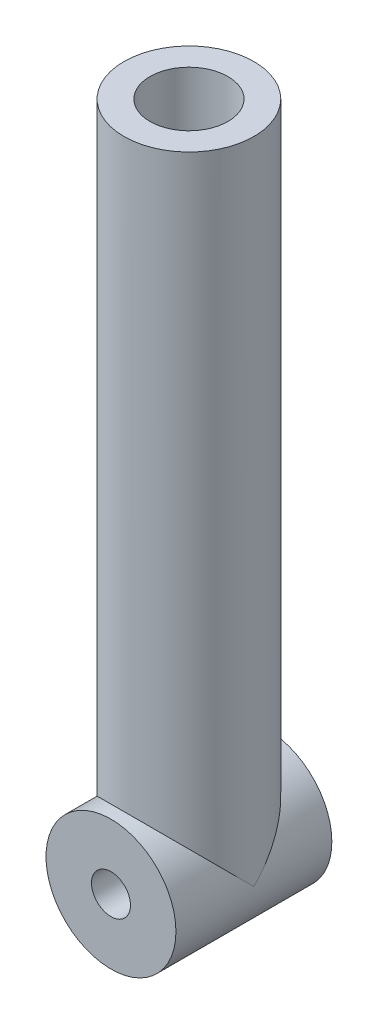
ISO-10303-21;
HEADER;
FILE_DESCRIPTION(('STEP AP214'),'2;1');
FILE_NAME('part.step','',(''),(''),'','','');
FILE_SCHEMA(('AUTOMOTIVE_DESIGN { 1 0 10303 214 1 1 1 1 }'));
ENDSEC;
DATA;
#1=APPLICATION_CONTEXT('core data for automotive mechanical design processes');
#2=APPLICATION_PROTOCOL_DEFINITION('international standard','automotive_design',2000,#1);
#3=PRODUCT_CONTEXT('',#1,'mechanical');
#4=PRODUCT('Part','Part','',(#3));
#5=PRODUCT_RELATED_PRODUCT_CATEGORY('part','',(#4));
#6=PRODUCT_DEFINITION_FORMATION('','',#4);
#7=PRODUCT_DEFINITION_CONTEXT('part definition',#1,'design');
#8=PRODUCT_DEFINITION('design','',#6,#7);
#9=PRODUCT_DEFINITION_SHAPE('','',#8);
#10=(LENGTH_UNIT() NAMED_UNIT(*) SI_UNIT(.MILLI.,.METRE.));
#11=(NAMED_UNIT(*) PLANE_ANGLE_UNIT() SI_UNIT($,.RADIAN.));
#12=(NAMED_UNIT(*) SI_UNIT($,.STERADIAN.) SOLID_ANGLE_UNIT());
#13=UNCERTAINTY_MEASURE_WITH_UNIT(LENGTH_MEASURE(1.E-05),#10,'distance_accuracy_value','');
#14=(GEOMETRIC_REPRESENTATION_CONTEXT(3) GLOBAL_UNCERTAINTY_ASSIGNED_CONTEXT((#13)) GLOBAL_UNIT_ASSIGNED_CONTEXT((#10,
#11,#12)) REPRESENTATION_CONTEXT('',''));
#15=CARTESIAN_POINT('',(0.,0.,0.));
#16=DIRECTION('',(0.,0.,1.));
#17=DIRECTION('',(1.,0.,0.));
#18=AXIS2_PLACEMENT_3D('',#15,#16,#17);
#19=CARTESIAN_POINT('',(0.,250.,0.));
#20=DIRECTION('',(0.,-1.,0.));
#21=DIRECTION('',(0.,0.,-1.));
#22=AXIS2_PLACEMENT_3D('',#19,#20,#21);
#23=CYLINDRICAL_SURFACE('',#22,25.);
#24=CARTESIAN_POINT('',(0.,250.,0.));
#25=DIRECTION('',(0.,1.,0.));
#26=DIRECTION('',(0.,0.,1.));
#27=AXIS2_PLACEMENT_3D('',#24,#25,#26);
#28=CIRCLE('',#27,25.);
#29=CARTESIAN_POINT('',(0.,250.,25.));
#30=VERTEX_POINT('',#29);
#31=EDGE_CURVE('E10',#30,#30,#28,.T.);
#32=ORIENTED_EDGE('',*,*,#31,.F.);
#33=EDGE_LOOP('',(#32));
#34=FACE_BOUND('',#33,.T.);
#35=CARTESIAN_POINT('',(0.,0.,0.));
#36=DIRECTION('',(0.,-0.707106781186548,-0.707106781186548));
#37=DIRECTION('',(0.,-0.707106781186548,0.707106781186548));
#38=AXIS2_PLACEMENT_3D('',#35,#36,#37);
#39=ELLIPSE('',#38,35.3553390593274,25.);
#40=CARTESIAN_POINT('',(-25.,0.,0.));
#41=VERTEX_POINT('',#40);
#42=CARTESIAN_POINT('',(25.,0.,0.));
#43=VERTEX_POINT('',#42);
#44=EDGE_CURVE('E23',#41,#43,#39,.T.);
#45=ORIENTED_EDGE('',*,*,#44,.F.);
#46=CARTESIAN_POINT('',(0.,0.,0.));
#47=DIRECTION('',(0.,-0.707106781186548,0.707106781186548));
#48=DIRECTION('',(0.,-0.707106781186548,-0.707106781186548));
#49=AXIS2_PLACEMENT_3D('',#46,#47,#48);
#50=ELLIPSE('',#49,35.3553390593274,25.);
#51=EDGE_CURVE('E29',#43,#41,#50,.T.);
#52=ORIENTED_EDGE('',*,*,#51,.F.);
#53=EDGE_LOOP('',(#45,#52));
#54=FACE_BOUND('',#53,.T.);
#55=ADVANCED_FACE('F16',(#34,#54),#23,.T.);
#56=CARTESIAN_POINT('',(0.,250.,0.));
#57=DIRECTION('',(0.,1.,0.));
#58=DIRECTION('',(0.,0.,1.));
#59=AXIS2_PLACEMENT_3D('',#56,#57,#58);
#60=PLANE('',#59);
#61=CARTESIAN_POINT('',(0.,250.,0.));
#62=DIRECTION('',(0.,1.,0.));
#63=DIRECTION('',(0.,0.,1.));
#64=AXIS2_PLACEMENT_3D('',#61,#62,#63);
#65=CIRCLE('',#64,15.);
#66=CARTESIAN_POINT('',(0.,250.,15.));
#67=VERTEX_POINT('',#66);
#68=EDGE_CURVE('E48',#67,#67,#65,.T.);
#69=ORIENTED_EDGE('',*,*,#68,.F.);
#70=EDGE_LOOP('',(#69));
#71=FACE_BOUND('',#70,.T.);
#72=ORIENTED_EDGE('',*,*,#31,.T.);
#73=EDGE_LOOP('',(#72));
#74=FACE_BOUND('',#73,.T.);
#75=ADVANCED_FACE('F63',(#71,#74),#60,.T.);
#76=CARTESIAN_POINT('',(0.,0.,30.));
#77=DIRECTION('',(0.,0.,-1.));
#78=DIRECTION('',(-1.,0.,0.));
#79=AXIS2_PLACEMENT_3D('',#76,#77,#78);
#80=CYLINDRICAL_SURFACE('',#79,25.);
#81=CARTESIAN_POINT('',(0.,0.,-30.));
#82=DIRECTION('',(0.,0.,1.));
#83=DIRECTION('',(1.,0.,0.));
#84=AXIS2_PLACEMENT_3D('',#81,#82,#83);
#85=CIRCLE('',#84,25.);
#86=CARTESIAN_POINT('',(25.,0.,-30.));
#87=VERTEX_POINT('',#86);
#88=EDGE_CURVE('E36',#87,#87,#85,.T.);
#89=ORIENTED_EDGE('',*,*,#88,.T.);
#90=EDGE_LOOP('',(#89));
#91=FACE_BOUND('',#90,.T.);
#92=CARTESIAN_POINT('',(0.,0.,30.));
#93=DIRECTION('',(0.,0.,1.));
#94=DIRECTION('',(1.,0.,0.));
#95=AXIS2_PLACEMENT_3D('',#92,#93,#94);
#96=CIRCLE('',#95,25.);
#97=CARTESIAN_POINT('',(25.,0.,30.));
#98=VERTEX_POINT('',#97);
#99=EDGE_CURVE('E33',#98,#98,#96,.T.);
#100=ORIENTED_EDGE('',*,*,#99,.F.);
#101=EDGE_LOOP('',(#100));
#102=FACE_BOUND('',#101,.T.);
#103=ORIENTED_EDGE('',*,*,#51,.T.);
#104=ORIENTED_EDGE('',*,*,#44,.T.);
#105=EDGE_LOOP('',(#103,#104));
#106=FACE_BOUND('',#105,.T.);
#107=ADVANCED_FACE('F32',(#91,#102,#106),#80,.T.);
#108=CARTESIAN_POINT('',(0.,0.,30.));
#109=DIRECTION('',(0.,0.,1.));
#110=DIRECTION('',(1.,0.,0.));
#111=AXIS2_PLACEMENT_3D('',#108,#109,#110);
#112=PLANE('',#111);
#113=CARTESIAN_POINT('',(0.,0.,30.));
#114=DIRECTION('',(0.,0.,1.));
#115=DIRECTION('',(1.,0.,0.));
#116=AXIS2_PLACEMENT_3D('',#113,#114,#115);
#117=CIRCLE('',#116,7.5);
#118=CARTESIAN_POINT('',(7.5,0.,30.));
#119=VERTEX_POINT('',#118);
#120=EDGE_CURVE('E42',#119,#119,#117,.T.);
#121=ORIENTED_EDGE('',*,*,#120,.F.);
#122=EDGE_LOOP('',(#121));
#123=FACE_BOUND('',#122,.T.);
#124=ORIENTED_EDGE('',*,*,#99,.T.);
#125=EDGE_LOOP('',(#124));
#126=FACE_BOUND('',#125,.T.);
#127=ADVANCED_FACE('F89',(#123,#126),#112,.T.);
#128=CARTESIAN_POINT('',(0.,0.,-30.));
#129=DIRECTION('',(0.,0.,1.));
#130=DIRECTION('',(1.,0.,0.));
#131=AXIS2_PLACEMENT_3D('',#128,#129,#130);
#132=PLANE('',#131);
#133=CARTESIAN_POINT('',(0.,0.,-30.));
#134=DIRECTION('',(0.,0.,1.));
#135=DIRECTION('',(1.,0.,0.));
#136=AXIS2_PLACEMENT_3D('',#133,#134,#135);
#137=CIRCLE('',#136,7.5);
#138=CARTESIAN_POINT('',(7.5,0.,-30.));
#139=VERTEX_POINT('',#138);
#140=EDGE_CURVE('E40',#139,#139,#137,.T.);
#141=ORIENTED_EDGE('',*,*,#140,.T.);
#142=EDGE_LOOP('',(#141));
#143=FACE_BOUND('',#142,.T.);
#144=ORIENTED_EDGE('',*,*,#88,.F.);
#145=EDGE_LOOP('',(#144));
#146=FACE_BOUND('',#145,.T.);
#147=ADVANCED_FACE('F98',(#143,#146),#132,.F.);
#148=CARTESIAN_POINT('',(0.,0.,-30.));
#149=DIRECTION('',(0.,0.,1.));
#150=DIRECTION('',(1.,0.,0.));
#151=AXIS2_PLACEMENT_3D('',#148,#149,#150);
#152=CYLINDRICAL_SURFACE('',#151,7.5);
#153=ORIENTED_EDGE('',*,*,#140,.F.);
#154=EDGE_LOOP('',(#153));
#155=FACE_BOUND('',#154,.T.);
#156=ORIENTED_EDGE('',*,*,#120,.T.);
#157=EDGE_LOOP('',(#156));
#158=FACE_BOUND('',#157,.T.);
#159=ADVANCED_FACE('F59',(#155,#158),#152,.F.);
#160=CARTESIAN_POINT('',(0.,50.,0.));
#161=DIRECTION('',(0.,1.,0.));
#162=DIRECTION('',(0.,0.,1.));
#163=AXIS2_PLACEMENT_3D('',#160,#161,#162);
#164=CYLINDRICAL_SURFACE('',#163,15.);
#165=CARTESIAN_POINT('',(0.,50.,0.));
#166=DIRECTION('',(0.,1.,0.));
#167=DIRECTION('',(0.,0.,1.));
#168=AXIS2_PLACEMENT_3D('',#165,#166,#167);
#169=CIRCLE('',#168,15.);
#170=CARTESIAN_POINT('',(0.,50.,15.));
#171=VERTEX_POINT('',#170);
#172=EDGE_CURVE('E45',#171,#171,#169,.T.);
#173=ORIENTED_EDGE('',*,*,#172,.F.);
#174=EDGE_LOOP('',(#173));
#175=FACE_BOUND('',#174,.T.);
#176=ORIENTED_EDGE('',*,*,#68,.T.);
#177=EDGE_LOOP('',(#176));
#178=FACE_BOUND('',#177,.T.);
#179=ADVANCED_FACE('F56',(#175,#178),#164,.F.);
#180=CARTESIAN_POINT('',(0.,50.,0.));
#181=DIRECTION('',(0.,1.,0.));
#182=DIRECTION('',(0.,0.,1.));
#183=AXIS2_PLACEMENT_3D('',#180,#181,#182);
#184=PLANE('',#183);
#185=ORIENTED_EDGE('',*,*,#172,.T.);
#186=EDGE_LOOP('',(#185));
#187=FACE_BOUND('',#186,.T.);
#188=ADVANCED_FACE('F54',(#187),#184,.T.);
#189=CLOSED_SHELL('',(#55,#75,#107,#127,#147,#159,#179,#188));
#190=MANIFOLD_SOLID_BREP('B1',#189);
#191=ADVANCED_BREP_SHAPE_REPRESENTATION('',(#18,#190),#14);
#192=SHAPE_DEFINITION_REPRESENTATION(#9,#191);
ENDSEC;
END-ISO-10303-21;
